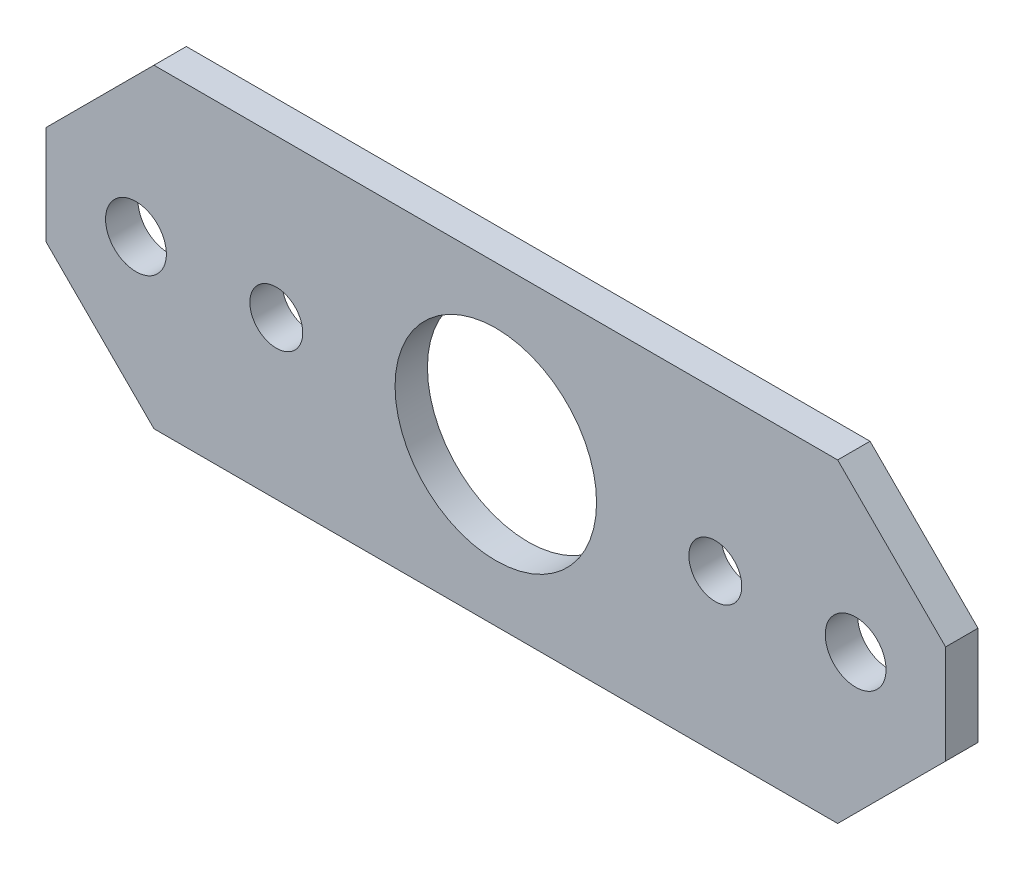
ISO-10303-21;
HEADER;
FILE_DESCRIPTION(('STEP AP214'),'2;1');
FILE_NAME('part.step','',(''),(''),'','','');
FILE_SCHEMA(('AUTOMOTIVE_DESIGN { 1 0 10303 214 1 1 1 1 }'));
ENDSEC;
DATA;
#1=APPLICATION_CONTEXT('core data for automotive mechanical design processes');
#2=APPLICATION_PROTOCOL_DEFINITION('international standard','automotive_design',2000,#1);
#3=PRODUCT_CONTEXT('',#1,'mechanical');
#4=PRODUCT('Part','Part','',(#3));
#5=PRODUCT_RELATED_PRODUCT_CATEGORY('part','',(#4));
#6=PRODUCT_DEFINITION_FORMATION('','',#4);
#7=PRODUCT_DEFINITION_CONTEXT('part definition',#1,'design');
#8=PRODUCT_DEFINITION('design','',#6,#7);
#9=PRODUCT_DEFINITION_SHAPE('','',#8);
#10=(LENGTH_UNIT() NAMED_UNIT(*) SI_UNIT(.MILLI.,.METRE.));
#11=(NAMED_UNIT(*) PLANE_ANGLE_UNIT() SI_UNIT($,.RADIAN.));
#12=(NAMED_UNIT(*) SI_UNIT($,.STERADIAN.) SOLID_ANGLE_UNIT());
#13=UNCERTAINTY_MEASURE_WITH_UNIT(LENGTH_MEASURE(1.E-05),#10,'distance_accuracy_value','');
#14=(GEOMETRIC_REPRESENTATION_CONTEXT(3) GLOBAL_UNCERTAINTY_ASSIGNED_CONTEXT((#13)) GLOBAL_UNIT_ASSIGNED_CONTEXT((#10,
#11,#12)) REPRESENTATION_CONTEXT('',''));
#15=CARTESIAN_POINT('',(0.,0.,0.));
#16=DIRECTION('',(0.,0.,1.));
#17=DIRECTION('',(1.,0.,0.));
#18=AXIS2_PLACEMENT_3D('',#15,#16,#17);
#19=CARTESIAN_POINT('',(-31.75,-11.1125,0.));
#20=DIRECTION('',(0.,0.,1.));
#21=DIRECTION('',(1.,0.,0.));
#22=AXIS2_PLACEMENT_3D('',#19,#20,#21);
#23=PLANE('',#22);
#24=DIRECTION('',(-0.707106781186548,0.707106781186548,0.));
#25=VECTOR('',#24,1.);
#26=CARTESIAN_POINT('',(-24.13,-11.1125,0.));
#27=LINE('',#26,#25);
#28=CARTESIAN_POINT('',(-24.13,-11.1125,0.));
#29=VERTEX_POINT('',#28);
#30=CARTESIAN_POINT('',(-31.75,-3.4925,0.));
#31=VERTEX_POINT('',#30);
#32=EDGE_CURVE('E82',#29,#31,#27,.T.);
#33=ORIENTED_EDGE('',*,*,#32,.T.);
#34=DIRECTION('',(0.,1.,0.));
#35=VECTOR('',#34,1.);
#36=CARTESIAN_POINT('',(-31.75,11.1125,0.));
#37=LINE('',#36,#35);
#38=CARTESIAN_POINT('',(-31.75,3.4925,0.));
#39=VERTEX_POINT('',#38);
#40=EDGE_CURVE('E85',#31,#39,#37,.T.);
#41=ORIENTED_EDGE('',*,*,#40,.T.);
#42=DIRECTION('',(0.707106781186547,0.707106781186548,0.));
#43=VECTOR('',#42,1.);
#44=CARTESIAN_POINT('',(-31.75,3.4925,0.));
#45=LINE('',#44,#43);
#46=CARTESIAN_POINT('',(-24.13,11.1125,0.));
#47=VERTEX_POINT('',#46);
#48=EDGE_CURVE('E336',#39,#47,#45,.T.);
#49=ORIENTED_EDGE('',*,*,#48,.T.);
#50=DIRECTION('',(1.,0.,0.));
#51=VECTOR('',#50,1.);
#52=CARTESIAN_POINT('',(-31.75,11.1125,0.));
#53=LINE('',#52,#51);
#54=CARTESIAN_POINT('',(24.13,11.1125,0.));
#55=VERTEX_POINT('',#54);
#56=EDGE_CURVE('E331',#47,#55,#53,.T.);
#57=ORIENTED_EDGE('',*,*,#56,.T.);
#58=DIRECTION('',(0.707106781186548,-0.707106781186547,0.));
#59=VECTOR('',#58,1.);
#60=CARTESIAN_POINT('',(24.13,11.1125,0.));
#61=LINE('',#60,#59);
#62=CARTESIAN_POINT('',(31.75,3.4925,0.));
#63=VERTEX_POINT('',#62);
#64=EDGE_CURVE('E327',#55,#63,#61,.T.);
#65=ORIENTED_EDGE('',*,*,#64,.T.);
#66=DIRECTION('',(0.,1.,0.));
#67=VECTOR('',#66,1.);
#68=CARTESIAN_POINT('',(31.75,11.1125,0.));
#69=LINE('',#68,#67);
#70=CARTESIAN_POINT('',(31.75,-3.4925,0.));
#71=VERTEX_POINT('',#70);
#72=EDGE_CURVE('E323',#63,#71,#69,.F.);
#73=ORIENTED_EDGE('',*,*,#72,.T.);
#74=DIRECTION('',(-0.707106781186548,-0.707106781186547,0.));
#75=VECTOR('',#74,1.);
#76=CARTESIAN_POINT('',(31.75,-3.4925,0.));
#77=LINE('',#76,#75);
#78=CARTESIAN_POINT('',(24.13,-11.1125,0.));
#79=VERTEX_POINT('',#78);
#80=EDGE_CURVE('E318',#71,#79,#77,.T.);
#81=ORIENTED_EDGE('',*,*,#80,.T.);
#82=DIRECTION('',(1.,0.,0.));
#83=VECTOR('',#82,1.);
#84=CARTESIAN_POINT('',(-31.75,-11.1125,0.));
#85=LINE('',#84,#83);
#86=EDGE_CURVE('E80',#79,#29,#85,.F.);
#87=ORIENTED_EDGE('',*,*,#86,.T.);
#88=EDGE_LOOP('',(#33,#41,#49,#57,#65,#73,#81,#87));
#89=FACE_BOUND('',#88,.T.);
#90=CARTESIAN_POINT('',(0.,0.,0.));
#91=DIRECTION('',(0.,0.,-1.));
#92=DIRECTION('',(-1.,0.,0.));
#93=AXIS2_PLACEMENT_3D('',#90,#91,#92);
#94=CIRCLE('',#93,7.112);
#95=CARTESIAN_POINT('',(-7.112,0.,0.));
#96=VERTEX_POINT('',#95);
#97=EDGE_CURVE('E98',#96,#96,#94,.F.);
#98=ORIENTED_EDGE('',*,*,#97,.T.);
#99=EDGE_LOOP('',(#98));
#100=FACE_BOUND('',#99,.T.);
#101=CARTESIAN_POINT('',(25.4,0.,0.));
#102=DIRECTION('',(0.,0.,-1.));
#103=DIRECTION('',(-1.,0.,0.));
#104=AXIS2_PLACEMENT_3D('',#101,#102,#103);
#105=CIRCLE('',#104,2.1463);
#106=CARTESIAN_POINT('',(23.2537,0.,0.));
#107=VERTEX_POINT('',#106);
#108=EDGE_CURVE('E127',#107,#107,#105,.F.);
#109=ORIENTED_EDGE('',*,*,#108,.T.);
#110=EDGE_LOOP('',(#109));
#111=FACE_BOUND('',#110,.T.);
#112=CARTESIAN_POINT('',(-25.4,0.,0.));
#113=DIRECTION('',(0.,0.,-1.));
#114=DIRECTION('',(-1.,0.,0.));
#115=AXIS2_PLACEMENT_3D('',#112,#113,#114);
#116=CIRCLE('',#115,2.1463);
#117=CARTESIAN_POINT('',(-27.5463,0.,0.));
#118=VERTEX_POINT('',#117);
#119=EDGE_CURVE('E130',#118,#118,#116,.F.);
#120=ORIENTED_EDGE('',*,*,#119,.T.);
#121=EDGE_LOOP('',(#120));
#122=FACE_BOUND('',#121,.T.);
#123=CARTESIAN_POINT('',(15.494,0.,0.));
#124=DIRECTION('',(0.,0.,-1.));
#125=DIRECTION('',(-1.,0.,0.));
#126=AXIS2_PLACEMENT_3D('',#123,#124,#125);
#127=CIRCLE('',#126,1.8669);
#128=CARTESIAN_POINT('',(13.6271,0.,0.));
#129=VERTEX_POINT('',#128);
#130=EDGE_CURVE('E132',#129,#129,#127,.F.);
#131=ORIENTED_EDGE('',*,*,#130,.T.);
#132=EDGE_LOOP('',(#131));
#133=FACE_BOUND('',#132,.T.);
#134=CARTESIAN_POINT('',(-15.494,0.,0.));
#135=DIRECTION('',(0.,0.,-1.));
#136=DIRECTION('',(-1.,0.,0.));
#137=AXIS2_PLACEMENT_3D('',#134,#135,#136);
#138=CIRCLE('',#137,1.8669);
#139=CARTESIAN_POINT('',(-17.3609,0.,0.));
#140=VERTEX_POINT('',#139);
#141=EDGE_CURVE('E20',#140,#140,#138,.F.);
#142=ORIENTED_EDGE('',*,*,#141,.T.);
#143=EDGE_LOOP('',(#142));
#144=FACE_BOUND('',#143,.T.);
#145=ADVANCED_FACE('F17',(#89,#100,#111,#122,#133,#144),#23,.F.);
#146=CARTESIAN_POINT('',(-15.494,0.,2.286));
#147=DIRECTION('',(0.,0.,-1.));
#148=DIRECTION('',(-1.,0.,0.));
#149=AXIS2_PLACEMENT_3D('',#146,#147,#148);
#150=CYLINDRICAL_SURFACE('',#149,1.8669);
#151=ORIENTED_EDGE('',*,*,#141,.F.);
#152=EDGE_LOOP('',(#151));
#153=FACE_BOUND('',#152,.T.);
#154=CARTESIAN_POINT('',(-15.494,0.,2.286));
#155=DIRECTION('',(0.,0.,-1.));
#156=DIRECTION('',(-1.,0.,0.));
#157=AXIS2_PLACEMENT_3D('',#154,#155,#156);
#158=CIRCLE('',#157,1.8669);
#159=CARTESIAN_POINT('',(-17.3609,0.,2.286));
#160=VERTEX_POINT('',#159);
#161=EDGE_CURVE('E122',#160,#160,#158,.T.);
#162=ORIENTED_EDGE('',*,*,#161,.F.);
#163=EDGE_LOOP('',(#162));
#164=FACE_BOUND('',#163,.T.);
#165=ADVANCED_FACE('F140',(#153,#164),#150,.F.);
#166=CARTESIAN_POINT('',(15.494,0.,2.286));
#167=DIRECTION('',(0.,0.,-1.));
#168=DIRECTION('',(-1.,0.,0.));
#169=AXIS2_PLACEMENT_3D('',#166,#167,#168);
#170=CYLINDRICAL_SURFACE('',#169,1.8669);
#171=ORIENTED_EDGE('',*,*,#130,.F.);
#172=EDGE_LOOP('',(#171));
#173=FACE_BOUND('',#172,.T.);
#174=CARTESIAN_POINT('',(15.494,0.,2.286));
#175=DIRECTION('',(0.,0.,-1.));
#176=DIRECTION('',(-1.,0.,0.));
#177=AXIS2_PLACEMENT_3D('',#174,#175,#176);
#178=CIRCLE('',#177,1.8669);
#179=CARTESIAN_POINT('',(13.6271,0.,2.286));
#180=VERTEX_POINT('',#179);
#181=EDGE_CURVE('E119',#180,#180,#178,.T.);
#182=ORIENTED_EDGE('',*,*,#181,.F.);
#183=EDGE_LOOP('',(#182));
#184=FACE_BOUND('',#183,.T.);
#185=ADVANCED_FACE('F143',(#173,#184),#170,.F.);
#186=CARTESIAN_POINT('',(-25.4,0.,2.286));
#187=DIRECTION('',(0.,0.,-1.));
#188=DIRECTION('',(-1.,0.,0.));
#189=AXIS2_PLACEMENT_3D('',#186,#187,#188);
#190=CYLINDRICAL_SURFACE('',#189,2.1463);
#191=ORIENTED_EDGE('',*,*,#119,.F.);
#192=EDGE_LOOP('',(#191));
#193=FACE_BOUND('',#192,.T.);
#194=CARTESIAN_POINT('',(-25.4,0.,2.286));
#195=DIRECTION('',(0.,0.,-1.));
#196=DIRECTION('',(-1.,0.,0.));
#197=AXIS2_PLACEMENT_3D('',#194,#195,#196);
#198=CIRCLE('',#197,2.1463);
#199=CARTESIAN_POINT('',(-27.5463,0.,2.286));
#200=VERTEX_POINT('',#199);
#201=EDGE_CURVE('E116',#200,#200,#198,.T.);
#202=ORIENTED_EDGE('',*,*,#201,.F.);
#203=EDGE_LOOP('',(#202));
#204=FACE_BOUND('',#203,.T.);
#205=ADVANCED_FACE('F190',(#193,#204),#190,.F.);
#206=CARTESIAN_POINT('',(25.4,0.,2.286));
#207=DIRECTION('',(0.,0.,-1.));
#208=DIRECTION('',(-1.,0.,0.));
#209=AXIS2_PLACEMENT_3D('',#206,#207,#208);
#210=CYLINDRICAL_SURFACE('',#209,2.1463);
#211=ORIENTED_EDGE('',*,*,#108,.F.);
#212=EDGE_LOOP('',(#211));
#213=FACE_BOUND('',#212,.T.);
#214=CARTESIAN_POINT('',(25.4,0.,2.286));
#215=DIRECTION('',(0.,0.,-1.));
#216=DIRECTION('',(-1.,0.,0.));
#217=AXIS2_PLACEMENT_3D('',#214,#215,#216);
#218=CIRCLE('',#217,2.1463);
#219=CARTESIAN_POINT('',(23.2537,0.,2.286));
#220=VERTEX_POINT('',#219);
#221=EDGE_CURVE('E113',#220,#220,#218,.T.);
#222=ORIENTED_EDGE('',*,*,#221,.F.);
#223=EDGE_LOOP('',(#222));
#224=FACE_BOUND('',#223,.T.);
#225=ADVANCED_FACE('F186',(#213,#224),#210,.F.);
#226=CARTESIAN_POINT('',(0.,0.,2.286));
#227=DIRECTION('',(0.,0.,-1.));
#228=DIRECTION('',(-1.,0.,0.));
#229=AXIS2_PLACEMENT_3D('',#226,#227,#228);
#230=CYLINDRICAL_SURFACE('',#229,7.112);
#231=ORIENTED_EDGE('',*,*,#97,.F.);
#232=EDGE_LOOP('',(#231));
#233=FACE_BOUND('',#232,.T.);
#234=CARTESIAN_POINT('',(0.,0.,2.286));
#235=DIRECTION('',(0.,0.,-1.));
#236=DIRECTION('',(-1.,0.,0.));
#237=AXIS2_PLACEMENT_3D('',#234,#235,#236);
#238=CIRCLE('',#237,7.112);
#239=CARTESIAN_POINT('',(-7.112,0.,2.286));
#240=VERTEX_POINT('',#239);
#241=EDGE_CURVE('E109',#240,#240,#238,.T.);
#242=ORIENTED_EDGE('',*,*,#241,.F.);
#243=EDGE_LOOP('',(#242));
#244=FACE_BOUND('',#243,.T.);
#245=ADVANCED_FACE('F183',(#233,#244),#230,.F.);
#246=CARTESIAN_POINT('',(-31.75,11.1125,2.286));
#247=DIRECTION('',(1.,0.,0.));
#248=DIRECTION('',(0.,0.,-1.));
#249=AXIS2_PLACEMENT_3D('',#246,#247,#248);
#250=PLANE('',#249);
#251=DIRECTION('',(0.,0.,1.));
#252=VECTOR('',#251,1.);
#253=CARTESIAN_POINT('',(-31.75,-3.4925,2.286));
#254=LINE('',#253,#252);
#255=CARTESIAN_POINT('',(-31.75,-3.4925,2.286));
#256=VERTEX_POINT('',#255);
#257=EDGE_CURVE('E90',#31,#256,#254,.T.);
#258=ORIENTED_EDGE('',*,*,#257,.T.);
#259=DIRECTION('',(0.,1.,0.));
#260=VECTOR('',#259,1.);
#261=CARTESIAN_POINT('',(-31.75,-11.1125,2.286));
#262=LINE('',#261,#260);
#263=CARTESIAN_POINT('',(-31.75,3.4925,2.286));
#264=VERTEX_POINT('',#263);
#265=EDGE_CURVE('E112',#264,#256,#262,.F.);
#266=ORIENTED_EDGE('',*,*,#265,.F.);
#267=DIRECTION('',(0.,0.,1.));
#268=VECTOR('',#267,1.);
#269=CARTESIAN_POINT('',(-31.75,3.4925,2.286));
#270=LINE('',#269,#268);
#271=EDGE_CURVE('E96',#264,#39,#270,.F.);
#272=ORIENTED_EDGE('',*,*,#271,.T.);
#273=ORIENTED_EDGE('',*,*,#40,.F.);
#274=EDGE_LOOP('',(#258,#266,#272,#273));
#275=FACE_BOUND('',#274,.T.);
#276=ADVANCED_FACE('F93',(#275),#250,.F.);
#277=CARTESIAN_POINT('',(-24.13,-11.1125,2.286));
#278=DIRECTION('',(0.707106781186548,0.707106781186548,0.));
#279=DIRECTION('',(-0.707106781186548,0.707106781186548,0.));
#280=AXIS2_PLACEMENT_3D('',#277,#278,#279);
#281=PLANE('',#280);
#282=ORIENTED_EDGE('',*,*,#257,.F.);
#283=ORIENTED_EDGE('',*,*,#32,.F.);
#284=DIRECTION('',(0.,0.,1.));
#285=VECTOR('',#284,1.);
#286=CARTESIAN_POINT('',(-24.13,-11.1125,2.286));
#287=LINE('',#286,#285);
#288=CARTESIAN_POINT('',(-24.13,-11.1125,2.286));
#289=VERTEX_POINT('',#288);
#290=EDGE_CURVE('E105',#29,#289,#287,.T.);
#291=ORIENTED_EDGE('',*,*,#290,.T.);
#292=DIRECTION('',(0.707106781186547,-0.707106781186548,0.));
#293=VECTOR('',#292,1.);
#294=CARTESIAN_POINT('',(-31.75,-3.49249999999999,2.286));
#295=LINE('',#294,#293);
#296=EDGE_CURVE('E102',#256,#289,#295,.T.);
#297=ORIENTED_EDGE('',*,*,#296,.F.);
#298=EDGE_LOOP('',(#282,#283,#291,#297));
#299=FACE_BOUND('',#298,.T.);
#300=ADVANCED_FACE('F100',(#299),#281,.F.);
#301=CARTESIAN_POINT('',(-31.75,-11.1125,2.286));
#302=DIRECTION('',(0.,1.,0.));
#303=DIRECTION('',(0.,0.,1.));
#304=AXIS2_PLACEMENT_3D('',#301,#302,#303);
#305=PLANE('',#304);
#306=ORIENTED_EDGE('',*,*,#290,.F.);
#307=ORIENTED_EDGE('',*,*,#86,.F.);
#308=DIRECTION('',(0.,0.,1.));
#309=VECTOR('',#308,1.);
#310=CARTESIAN_POINT('',(24.13,-11.1125,2.286));
#311=LINE('',#310,#309);
#312=CARTESIAN_POINT('',(24.13,-11.1125,2.286));
#313=VERTEX_POINT('',#312);
#314=EDGE_CURVE('E319',#79,#313,#311,.T.);
#315=ORIENTED_EDGE('',*,*,#314,.T.);
#316=DIRECTION('',(1.,0.,0.));
#317=VECTOR('',#316,1.);
#318=CARTESIAN_POINT('',(-31.75,-11.1125,2.286));
#319=LINE('',#318,#317);
#320=EDGE_CURVE('E317',#289,#313,#319,.T.);
#321=ORIENTED_EDGE('',*,*,#320,.F.);
#322=EDGE_LOOP('',(#306,#307,#315,#321));
#323=FACE_BOUND('',#322,.T.);
#324=ADVANCED_FACE('F174',(#323),#305,.F.);
#325=CARTESIAN_POINT('',(31.75,-3.4925,2.286));
#326=DIRECTION('',(-0.707106781186547,0.707106781186548,0.));
#327=DIRECTION('',(-0.707106781186548,-0.707106781186547,0.));
#328=AXIS2_PLACEMENT_3D('',#325,#326,#327);
#329=PLANE('',#328);
#330=ORIENTED_EDGE('',*,*,#314,.F.);
#331=ORIENTED_EDGE('',*,*,#80,.F.);
#332=DIRECTION('',(0.,0.,1.));
#333=VECTOR('',#332,1.);
#334=CARTESIAN_POINT('',(31.75,-3.4925,2.286));
#335=LINE('',#334,#333);
#336=CARTESIAN_POINT('',(31.75,-3.4925,2.286));
#337=VERTEX_POINT('',#336);
#338=EDGE_CURVE('E325',#71,#337,#335,.T.);
#339=ORIENTED_EDGE('',*,*,#338,.T.);
#340=DIRECTION('',(0.707106781186548,0.707106781186547,0.));
#341=VECTOR('',#340,1.);
#342=CARTESIAN_POINT('',(24.13,-11.1125,2.286));
#343=LINE('',#342,#341);
#344=EDGE_CURVE('E342',#313,#337,#343,.T.);
#345=ORIENTED_EDGE('',*,*,#344,.F.);
#346=EDGE_LOOP('',(#330,#331,#339,#345));
#347=FACE_BOUND('',#346,.T.);
#348=ADVANCED_FACE('F170',(#347),#329,.F.);
#349=CARTESIAN_POINT('',(31.75,11.1125,2.286));
#350=DIRECTION('',(-1.,0.,0.));
#351=DIRECTION('',(0.,0.,1.));
#352=AXIS2_PLACEMENT_3D('',#349,#350,#351);
#353=PLANE('',#352);
#354=ORIENTED_EDGE('',*,*,#338,.F.);
#355=ORIENTED_EDGE('',*,*,#72,.F.);
#356=DIRECTION('',(0.,0.,1.));
#357=VECTOR('',#356,1.);
#358=CARTESIAN_POINT('',(31.75,3.4925,2.286));
#359=LINE('',#358,#357);
#360=CARTESIAN_POINT('',(31.75,3.4925,2.286));
#361=VERTEX_POINT('',#360);
#362=EDGE_CURVE('E329',#63,#361,#359,.T.);
#363=ORIENTED_EDGE('',*,*,#362,.T.);
#364=DIRECTION('',(0.,1.,0.));
#365=VECTOR('',#364,1.);
#366=CARTESIAN_POINT('',(31.75,-11.1125,2.286));
#367=LINE('',#366,#365);
#368=EDGE_CURVE('E345',#337,#361,#367,.T.);
#369=ORIENTED_EDGE('',*,*,#368,.F.);
#370=EDGE_LOOP('',(#354,#355,#363,#369));
#371=FACE_BOUND('',#370,.T.);
#372=ADVANCED_FACE('F166',(#371),#353,.F.);
#373=CARTESIAN_POINT('',(24.13,11.1125,2.286));
#374=DIRECTION('',(-0.707106781186547,-0.707106781186548,0.));
#375=DIRECTION('',(0.707106781186548,-0.707106781186547,0.));
#376=AXIS2_PLACEMENT_3D('',#373,#374,#375);
#377=PLANE('',#376);
#378=ORIENTED_EDGE('',*,*,#362,.F.);
#379=ORIENTED_EDGE('',*,*,#64,.F.);
#380=DIRECTION('',(0.,0.,-1.));
#381=VECTOR('',#380,1.);
#382=CARTESIAN_POINT('',(24.13,11.1125,2.286));
#383=LINE('',#382,#381);
#384=CARTESIAN_POINT('',(24.13,11.1125,2.286));
#385=VERTEX_POINT('',#384);
#386=EDGE_CURVE('E333',#55,#385,#383,.F.);
#387=ORIENTED_EDGE('',*,*,#386,.T.);
#388=DIRECTION('',(-0.707106781186547,0.707106781186547,0.));
#389=VECTOR('',#388,1.);
#390=CARTESIAN_POINT('',(31.75,3.49249999999999,2.286));
#391=LINE('',#390,#389);
#392=EDGE_CURVE('E348',#361,#385,#391,.T.);
#393=ORIENTED_EDGE('',*,*,#392,.F.);
#394=EDGE_LOOP('',(#378,#379,#387,#393));
#395=FACE_BOUND('',#394,.T.);
#396=ADVANCED_FACE('F163',(#395),#377,.F.);
#397=CARTESIAN_POINT('',(-31.75,11.1125,2.286));
#398=DIRECTION('',(0.,-1.,0.));
#399=DIRECTION('',(0.,0.,-1.));
#400=AXIS2_PLACEMENT_3D('',#397,#398,#399);
#401=PLANE('',#400);
#402=ORIENTED_EDGE('',*,*,#386,.F.);
#403=ORIENTED_EDGE('',*,*,#56,.F.);
#404=DIRECTION('',(0.,0.,1.));
#405=VECTOR('',#404,1.);
#406=CARTESIAN_POINT('',(-24.13,11.1125,2.286));
#407=LINE('',#406,#405);
#408=CARTESIAN_POINT('',(-24.13,11.1125,2.286));
#409=VERTEX_POINT('',#408);
#410=EDGE_CURVE('E35',#47,#409,#407,.T.);
#411=ORIENTED_EDGE('',*,*,#410,.T.);
#412=DIRECTION('',(1.,0.,0.));
#413=VECTOR('',#412,1.);
#414=CARTESIAN_POINT('',(-31.75,11.1125,2.286));
#415=LINE('',#414,#413);
#416=EDGE_CURVE('E26',#385,#409,#415,.F.);
#417=ORIENTED_EDGE('',*,*,#416,.F.);
#418=EDGE_LOOP('',(#402,#403,#411,#417));
#419=FACE_BOUND('',#418,.T.);
#420=ADVANCED_FACE('F155',(#419),#401,.F.);
#421=CARTESIAN_POINT('',(-31.75,3.4925,2.286));
#422=DIRECTION('',(0.707106781186548,-0.707106781186547,0.));
#423=DIRECTION('',(0.707106781186547,0.707106781186548,0.));
#424=AXIS2_PLACEMENT_3D('',#421,#422,#423);
#425=PLANE('',#424);
#426=ORIENTED_EDGE('',*,*,#410,.F.);
#427=ORIENTED_EDGE('',*,*,#48,.F.);
#428=ORIENTED_EDGE('',*,*,#271,.F.);
#429=DIRECTION('',(-0.707106781186547,-0.707106781186548,0.));
#430=VECTOR('',#429,1.);
#431=CARTESIAN_POINT('',(-24.13,11.1125,2.286));
#432=LINE('',#431,#430);
#433=EDGE_CURVE('E11',#409,#264,#432,.T.);
#434=ORIENTED_EDGE('',*,*,#433,.F.);
#435=EDGE_LOOP('',(#426,#427,#428,#434));
#436=FACE_BOUND('',#435,.T.);
#437=ADVANCED_FACE('F148',(#436),#425,.F.);
#438=CARTESIAN_POINT('',(-31.75,-11.1125,2.286));
#439=DIRECTION('',(0.,0.,1.));
#440=DIRECTION('',(1.,0.,0.));
#441=AXIS2_PLACEMENT_3D('',#438,#439,#440);
#442=PLANE('',#441);
#443=ORIENTED_EDGE('',*,*,#416,.T.);
#444=ORIENTED_EDGE('',*,*,#433,.T.);
#445=ORIENTED_EDGE('',*,*,#265,.T.);
#446=ORIENTED_EDGE('',*,*,#296,.T.);
#447=ORIENTED_EDGE('',*,*,#320,.T.);
#448=ORIENTED_EDGE('',*,*,#344,.T.);
#449=ORIENTED_EDGE('',*,*,#368,.T.);
#450=ORIENTED_EDGE('',*,*,#392,.T.);
#451=EDGE_LOOP('',(#443,#444,#445,#446,#447,#448,#449,#450));
#452=FACE_BOUND('',#451,.T.);
#453=ORIENTED_EDGE('',*,*,#241,.T.);
#454=EDGE_LOOP('',(#453));
#455=FACE_BOUND('',#454,.T.);
#456=ORIENTED_EDGE('',*,*,#221,.T.);
#457=EDGE_LOOP('',(#456));
#458=FACE_BOUND('',#457,.T.);
#459=ORIENTED_EDGE('',*,*,#201,.T.);
#460=EDGE_LOOP('',(#459));
#461=FACE_BOUND('',#460,.T.);
#462=ORIENTED_EDGE('',*,*,#181,.T.);
#463=EDGE_LOOP('',(#462));
#464=FACE_BOUND('',#463,.T.);
#465=ORIENTED_EDGE('',*,*,#161,.T.);
#466=EDGE_LOOP('',(#465));
#467=FACE_BOUND('',#466,.T.);
#468=ADVANCED_FACE('F146',(#452,#455,#458,#461,#464,#467),#442,.T.);
#469=CLOSED_SHELL('',(#145,#165,#185,#205,#225,#245,#276,#300,#324,#348,#372,#396,#420,#437,#468));
#470=MANIFOLD_SOLID_BREP('B1',#469);
#471=ADVANCED_BREP_SHAPE_REPRESENTATION('',(#18,#470),#14);
#472=SHAPE_DEFINITION_REPRESENTATION(#9,#471);
ENDSEC;
END-ISO-10303-21;
